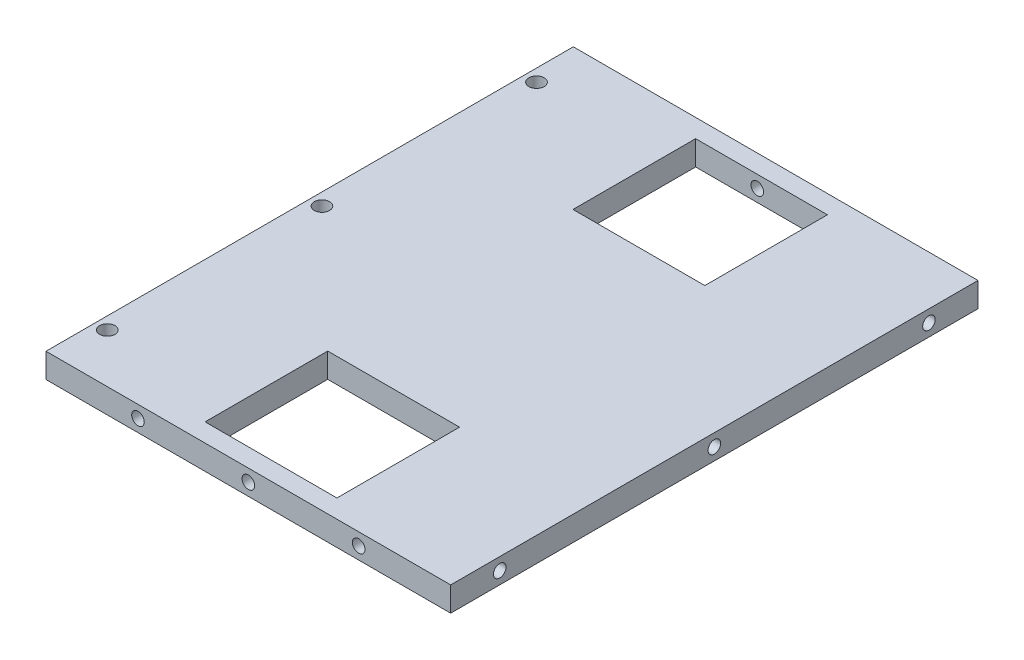
ISO-10303-21;
HEADER;
FILE_DESCRIPTION(('STEP AP214'),'2;1');
FILE_NAME('part.step','',(''),(''),'','','');
FILE_SCHEMA(('AUTOMOTIVE_DESIGN { 1 0 10303 214 1 1 1 1 }'));
ENDSEC;
DATA;
#1=APPLICATION_CONTEXT('core data for automotive mechanical design processes');
#2=APPLICATION_PROTOCOL_DEFINITION('international standard','automotive_design',2000,#1);
#3=PRODUCT_CONTEXT('',#1,'mechanical');
#4=PRODUCT('Part','Part','',(#3));
#5=PRODUCT_RELATED_PRODUCT_CATEGORY('part','',(#4));
#6=PRODUCT_DEFINITION_FORMATION('','',#4);
#7=PRODUCT_DEFINITION_CONTEXT('part definition',#1,'design');
#8=PRODUCT_DEFINITION('design','',#6,#7);
#9=PRODUCT_DEFINITION_SHAPE('','',#8);
#10=(LENGTH_UNIT() NAMED_UNIT(*) SI_UNIT(.MILLI.,.METRE.));
#11=(NAMED_UNIT(*) PLANE_ANGLE_UNIT() SI_UNIT($,.RADIAN.));
#12=(NAMED_UNIT(*) SI_UNIT($,.STERADIAN.) SOLID_ANGLE_UNIT());
#13=UNCERTAINTY_MEASURE_WITH_UNIT(LENGTH_MEASURE(1.E-05),#10,'distance_accuracy_value','');
#14=(GEOMETRIC_REPRESENTATION_CONTEXT(3) GLOBAL_UNCERTAINTY_ASSIGNED_CONTEXT((#13)) GLOBAL_UNIT_ASSIGNED_CONTEXT((#10,
#11,#12)) REPRESENTATION_CONTEXT('',''));
#15=CARTESIAN_POINT('',(0.,0.,0.));
#16=DIRECTION('',(0.,0.,1.));
#17=DIRECTION('',(1.,0.,0.));
#18=AXIS2_PLACEMENT_3D('',#15,#16,#17);
#19=CARTESIAN_POINT('',(0.,4.,0.));
#20=DIRECTION('',(0.,-1.,0.));
#21=DIRECTION('',(0.,0.,-1.));
#22=AXIS2_PLACEMENT_3D('',#19,#20,#21);
#23=PLANE('',#22);
#24=DIRECTION('',(0.,0.,1.));
#25=VECTOR('',#24,1.);
#26=CARTESIAN_POINT('',(22.9471530249112,4.,0.));
#27=LINE('',#26,#25);
#28=CARTESIAN_POINT('',(22.9471530249112,4.,19.9999999999999));
#29=VERTEX_POINT('',#28);
#30=CARTESIAN_POINT('',(22.9471530249112,4.,39.9999999999999));
#31=VERTEX_POINT('',#30);
#32=EDGE_CURVE('E263',#29,#31,#27,.T.);
#33=ORIENTED_EDGE('',*,*,#32,.F.);
#34=DIRECTION('',(-1.,0.,0.));
#35=VECTOR('',#34,1.);
#36=CARTESIAN_POINT('',(0.,4.,19.9999999999999));
#37=LINE('',#36,#35);
#38=CARTESIAN_POINT('',(44.4471530249111,4.,19.9999999999999));
#39=VERTEX_POINT('',#38);
#40=EDGE_CURVE('E256',#39,#29,#37,.T.);
#41=ORIENTED_EDGE('',*,*,#40,.F.);
#42=DIRECTION('',(0.,0.,-1.));
#43=VECTOR('',#42,1.);
#44=CARTESIAN_POINT('',(44.4471530249111,4.,0.));
#45=LINE('',#44,#43);
#46=CARTESIAN_POINT('',(44.4471530249111,4.,39.9999999999999));
#47=VERTEX_POINT('',#46);
#48=EDGE_CURVE('E258',#47,#39,#45,.T.);
#49=ORIENTED_EDGE('',*,*,#48,.F.);
#50=DIRECTION('',(1.,0.,0.));
#51=VECTOR('',#50,1.);
#52=CARTESIAN_POINT('',(0.,4.,39.9999999999999));
#53=LINE('',#52,#51);
#54=EDGE_CURVE('E261',#31,#47,#53,.T.);
#55=ORIENTED_EDGE('',*,*,#54,.F.);
#56=EDGE_LOOP('',(#33,#41,#49,#55));
#57=FACE_BOUND('',#56,.T.);
#58=DIRECTION('',(0.,0.,1.));
#59=VECTOR('',#58,1.);
#60=CARTESIAN_POINT('',(0.,4.,0.));
#61=LINE('',#60,#59);
#62=CARTESIAN_POINT('',(0.,4.,-43.));
#63=VERTEX_POINT('',#62);
#64=CARTESIAN_POINT('',(0.,4.,43.));
#65=VERTEX_POINT('',#64);
#66=EDGE_CURVE('E284',#63,#65,#61,.T.);
#67=ORIENTED_EDGE('',*,*,#66,.T.);
#68=DIRECTION('',(1.,0.,0.));
#69=VECTOR('',#68,1.);
#70=CARTESIAN_POINT('',(66.,4.,43.));
#71=LINE('',#70,#69);
#72=CARTESIAN_POINT('',(66.,4.,43.));
#73=VERTEX_POINT('',#72);
#74=EDGE_CURVE('E287',#65,#73,#71,.T.);
#75=ORIENTED_EDGE('',*,*,#74,.T.);
#76=DIRECTION('',(0.,0.,-1.));
#77=VECTOR('',#76,1.);
#78=CARTESIAN_POINT('',(66.,4.,-43.));
#79=LINE('',#78,#77);
#80=CARTESIAN_POINT('',(66.,4.,-43.));
#81=VERTEX_POINT('',#80);
#82=EDGE_CURVE('E290',#73,#81,#79,.T.);
#83=ORIENTED_EDGE('',*,*,#82,.T.);
#84=DIRECTION('',(-1.,0.,0.));
#85=VECTOR('',#84,1.);
#86=CARTESIAN_POINT('',(0.,4.,-43.));
#87=LINE('',#86,#85);
#88=EDGE_CURVE('E292',#81,#63,#87,.T.);
#89=ORIENTED_EDGE('',*,*,#88,.T.);
#90=EDGE_LOOP('',(#67,#75,#83,#89));
#91=FACE_BOUND('',#90,.T.);
#92=CARTESIAN_POINT('',(2.,4.,0.));
#93=DIRECTION('',(0.,1.,0.));
#94=DIRECTION('',(0.,0.,1.));
#95=AXIS2_PLACEMENT_3D('',#92,#93,#94);
#96=CIRCLE('',#95,1.25);
#97=CARTESIAN_POINT('',(2.,4.,1.25));
#98=VERTEX_POINT('',#97);
#99=EDGE_CURVE('E278',#98,#98,#96,.T.);
#100=ORIENTED_EDGE('',*,*,#99,.F.);
#101=EDGE_LOOP('',(#100));
#102=FACE_BOUND('',#101,.T.);
#103=CARTESIAN_POINT('',(1.99999999999988,4.,-35.));
#104=DIRECTION('',(0.,1.,0.));
#105=DIRECTION('',(0.,0.,1.));
#106=AXIS2_PLACEMENT_3D('',#103,#104,#105);
#107=CIRCLE('',#106,1.25);
#108=CARTESIAN_POINT('',(1.99999999999988,4.,-33.75));
#109=VERTEX_POINT('',#108);
#110=EDGE_CURVE('E272',#109,#109,#107,.T.);
#111=ORIENTED_EDGE('',*,*,#110,.F.);
#112=EDGE_LOOP('',(#111));
#113=FACE_BOUND('',#112,.T.);
#114=CARTESIAN_POINT('',(2.00000000000037,4.,35.));
#115=DIRECTION('',(0.,1.,0.));
#116=DIRECTION('',(0.,0.,1.));
#117=AXIS2_PLACEMENT_3D('',#114,#115,#116);
#118=CIRCLE('',#117,1.25);
#119=CARTESIAN_POINT('',(2.00000000000037,4.,36.25));
#120=VERTEX_POINT('',#119);
#121=EDGE_CURVE('E266',#120,#120,#118,.T.);
#122=ORIENTED_EDGE('',*,*,#121,.F.);
#123=EDGE_LOOP('',(#122));
#124=FACE_BOUND('',#123,.T.);
#125=DIRECTION('',(-1.,0.,0.));
#126=VECTOR('',#125,1.);
#127=CARTESIAN_POINT('',(0.,4.,-39.9999999999999));
#128=LINE('',#127,#126);
#129=CARTESIAN_POINT('',(44.4471530249111,4.,-39.9999999999999));
#130=VERTEX_POINT('',#129);
#131=CARTESIAN_POINT('',(22.9471530249112,4.,-39.9999999999999));
#132=VERTEX_POINT('',#131);
#133=EDGE_CURVE('E233',#130,#132,#128,.T.);
#134=ORIENTED_EDGE('',*,*,#133,.F.);
#135=DIRECTION('',(0.,0.,-1.));
#136=VECTOR('',#135,1.);
#137=CARTESIAN_POINT('',(44.4471530249111,4.,0.));
#138=LINE('',#137,#136);
#139=CARTESIAN_POINT('',(44.4471530249111,4.,-19.9999999999999));
#140=VERTEX_POINT('',#139);
#141=EDGE_CURVE('E227',#140,#130,#138,.T.);
#142=ORIENTED_EDGE('',*,*,#141,.F.);
#143=DIRECTION('',(1.,0.,0.));
#144=VECTOR('',#143,1.);
#145=CARTESIAN_POINT('',(0.,4.,-19.9999999999999));
#146=LINE('',#145,#144);
#147=CARTESIAN_POINT('',(22.9471530249112,4.,-19.9999999999999));
#148=VERTEX_POINT('',#147);
#149=EDGE_CURVE('E229',#148,#140,#146,.T.);
#150=ORIENTED_EDGE('',*,*,#149,.F.);
#151=DIRECTION('',(0.,0.,1.));
#152=VECTOR('',#151,1.);
#153=CARTESIAN_POINT('',(22.9471530249112,4.,0.));
#154=LINE('',#153,#152);
#155=EDGE_CURVE('E231',#132,#148,#154,.T.);
#156=ORIENTED_EDGE('',*,*,#155,.F.);
#157=EDGE_LOOP('',(#134,#142,#150,#156));
#158=FACE_BOUND('',#157,.T.);
#159=ADVANCED_FACE('F38',(#57,#91,#102,#113,#124,#158),#23,.F.);
#160=CARTESIAN_POINT('',(0.,0.,0.));
#161=DIRECTION('',(0.,-1.,0.));
#162=DIRECTION('',(0.,0.,-1.));
#163=AXIS2_PLACEMENT_3D('',#160,#161,#162);
#164=PLANE('',#163);
#165=CARTESIAN_POINT('',(1.99999999999988,0.,-35.));
#166=DIRECTION('',(0.,1.,0.));
#167=DIRECTION('',(0.,0.,1.));
#168=AXIS2_PLACEMENT_3D('',#165,#166,#167);
#169=CIRCLE('',#168,1.25);
#170=CARTESIAN_POINT('',(1.99999999999988,0.,-33.75));
#171=VERTEX_POINT('',#170);
#172=EDGE_CURVE('E269',#171,#171,#169,.T.);
#173=ORIENTED_EDGE('',*,*,#172,.T.);
#174=EDGE_LOOP('',(#173));
#175=FACE_BOUND('',#174,.T.);
#176=DIRECTION('',(1.,0.,0.));
#177=VECTOR('',#176,1.);
#178=CARTESIAN_POINT('',(66.,0.,43.));
#179=LINE('',#178,#177);
#180=CARTESIAN_POINT('',(0.,0.,43.));
#181=VERTEX_POINT('',#180);
#182=CARTESIAN_POINT('',(66.,0.,43.));
#183=VERTEX_POINT('',#182);
#184=EDGE_CURVE('E281',#181,#183,#179,.T.);
#185=ORIENTED_EDGE('',*,*,#184,.F.);
#186=DIRECTION('',(0.,0.,1.));
#187=VECTOR('',#186,1.);
#188=CARTESIAN_POINT('',(0.,0.,0.));
#189=LINE('',#188,#187);
#190=CARTESIAN_POINT('',(0.,0.,-43.));
#191=VERTEX_POINT('',#190);
#192=EDGE_CURVE('E288',#191,#181,#189,.T.);
#193=ORIENTED_EDGE('',*,*,#192,.F.);
#194=DIRECTION('',(-1.,0.,0.));
#195=VECTOR('',#194,1.);
#196=CARTESIAN_POINT('',(0.,0.,-43.));
#197=LINE('',#196,#195);
#198=CARTESIAN_POINT('',(66.,0.,-43.));
#199=VERTEX_POINT('',#198);
#200=EDGE_CURVE('E299',#199,#191,#197,.T.);
#201=ORIENTED_EDGE('',*,*,#200,.F.);
#202=DIRECTION('',(0.,0.,-1.));
#203=VECTOR('',#202,1.);
#204=CARTESIAN_POINT('',(66.,0.,-43.));
#205=LINE('',#204,#203);
#206=EDGE_CURVE('E297',#183,#199,#205,.T.);
#207=ORIENTED_EDGE('',*,*,#206,.F.);
#208=EDGE_LOOP('',(#185,#193,#201,#207));
#209=FACE_BOUND('',#208,.T.);
#210=CARTESIAN_POINT('',(2.,0.,0.));
#211=DIRECTION('',(0.,1.,0.));
#212=DIRECTION('',(0.,0.,1.));
#213=AXIS2_PLACEMENT_3D('',#210,#211,#212);
#214=CIRCLE('',#213,1.25);
#215=CARTESIAN_POINT('',(2.,0.,1.25));
#216=VERTEX_POINT('',#215);
#217=EDGE_CURVE('E275',#216,#216,#214,.T.);
#218=ORIENTED_EDGE('',*,*,#217,.T.);
#219=EDGE_LOOP('',(#218));
#220=FACE_BOUND('',#219,.T.);
#221=CARTESIAN_POINT('',(2.00000000000037,0.,35.));
#222=DIRECTION('',(0.,1.,0.));
#223=DIRECTION('',(0.,0.,1.));
#224=AXIS2_PLACEMENT_3D('',#221,#222,#223);
#225=CIRCLE('',#224,1.25);
#226=CARTESIAN_POINT('',(2.00000000000037,0.,36.25));
#227=VERTEX_POINT('',#226);
#228=EDGE_CURVE('E265',#227,#227,#225,.T.);
#229=ORIENTED_EDGE('',*,*,#228,.T.);
#230=EDGE_LOOP('',(#229));
#231=FACE_BOUND('',#230,.T.);
#232=DIRECTION('',(-1.,0.,0.));
#233=VECTOR('',#232,1.);
#234=CARTESIAN_POINT('',(44.4471530249111,0.,19.9999999999999));
#235=LINE('',#234,#233);
#236=CARTESIAN_POINT('',(44.4471530249111,0.,19.9999999999999));
#237=VERTEX_POINT('',#236);
#238=CARTESIAN_POINT('',(22.9471530249112,0.,19.9999999999999));
#239=VERTEX_POINT('',#238);
#240=EDGE_CURVE('E244',#237,#239,#235,.T.);
#241=ORIENTED_EDGE('',*,*,#240,.T.);
#242=DIRECTION('',(0.,0.,1.));
#243=VECTOR('',#242,1.);
#244=CARTESIAN_POINT('',(22.9471530249112,0.,39.9999999999999));
#245=LINE('',#244,#243);
#246=CARTESIAN_POINT('',(22.9471530249112,0.,39.9999999999999));
#247=VERTEX_POINT('',#246);
#248=EDGE_CURVE('E235',#239,#247,#245,.T.);
#249=ORIENTED_EDGE('',*,*,#248,.T.);
#250=DIRECTION('',(1.,0.,0.));
#251=VECTOR('',#250,1.);
#252=CARTESIAN_POINT('',(22.9471530249112,0.,39.9999999999999));
#253=LINE('',#252,#251);
#254=CARTESIAN_POINT('',(44.4471530249111,0.,39.9999999999999));
#255=VERTEX_POINT('',#254);
#256=EDGE_CURVE('E238',#247,#255,#253,.T.);
#257=ORIENTED_EDGE('',*,*,#256,.T.);
#258=DIRECTION('',(0.,0.,-1.));
#259=VECTOR('',#258,1.);
#260=CARTESIAN_POINT('',(44.4471530249111,0.,39.9999999999999));
#261=LINE('',#260,#259);
#262=EDGE_CURVE('E241',#255,#237,#261,.T.);
#263=ORIENTED_EDGE('',*,*,#262,.T.);
#264=EDGE_LOOP('',(#241,#249,#257,#263));
#265=FACE_BOUND('',#264,.T.);
#266=DIRECTION('',(0.,0.,-1.));
#267=VECTOR('',#266,1.);
#268=CARTESIAN_POINT('',(44.4471530249111,0.,-39.9999999999999));
#269=LINE('',#268,#267);
#270=CARTESIAN_POINT('',(44.4471530249111,0.,-19.9999999999999));
#271=VERTEX_POINT('',#270);
#272=CARTESIAN_POINT('',(44.4471530249111,0.,-39.9999999999999));
#273=VERTEX_POINT('',#272);
#274=EDGE_CURVE('E217',#271,#273,#269,.T.);
#275=ORIENTED_EDGE('',*,*,#274,.T.);
#276=DIRECTION('',(-1.,0.,0.));
#277=VECTOR('',#276,1.);
#278=CARTESIAN_POINT('',(22.9471530249112,0.,-39.9999999999999));
#279=LINE('',#278,#277);
#280=CARTESIAN_POINT('',(22.9471530249112,0.,-39.9999999999999));
#281=VERTEX_POINT('',#280);
#282=EDGE_CURVE('E61',#273,#281,#279,.T.);
#283=ORIENTED_EDGE('',*,*,#282,.T.);
#284=DIRECTION('',(0.,0.,1.));
#285=VECTOR('',#284,1.);
#286=CARTESIAN_POINT('',(22.9471530249112,0.,-39.9999999999999));
#287=LINE('',#286,#285);
#288=CARTESIAN_POINT('',(22.9471530249112,0.,-19.9999999999999));
#289=VERTEX_POINT('',#288);
#290=EDGE_CURVE('E211',#281,#289,#287,.T.);
#291=ORIENTED_EDGE('',*,*,#290,.T.);
#292=DIRECTION('',(1.,0.,0.));
#293=VECTOR('',#292,1.);
#294=CARTESIAN_POINT('',(44.4471530249111,0.,-19.9999999999999));
#295=LINE('',#294,#293);
#296=EDGE_CURVE('E214',#289,#271,#295,.T.);
#297=ORIENTED_EDGE('',*,*,#296,.T.);
#298=EDGE_LOOP('',(#275,#283,#291,#297));
#299=FACE_BOUND('',#298,.T.);
#300=ADVANCED_FACE('F317',(#175,#209,#220,#231,#265,#299),#164,.T.);
#301=CARTESIAN_POINT('',(66.,4.,43.));
#302=DIRECTION('',(0.,0.,-1.));
#303=DIRECTION('',(-1.,0.,0.));
#304=AXIS2_PLACEMENT_3D('',#301,#302,#303);
#305=PLANE('',#304);
#306=CARTESIAN_POINT('',(15.,2.,43.));
#307=DIRECTION('',(0.,0.,1.));
#308=DIRECTION('',(1.,0.,0.));
#309=AXIS2_PLACEMENT_3D('',#306,#307,#308);
#310=CIRCLE('',#309,1.02499999999999);
#311=CARTESIAN_POINT('',(16.025,2.,43.));
#312=VERTEX_POINT('',#311);
#313=EDGE_CURVE('E192',#312,#312,#310,.T.);
#314=ORIENTED_EDGE('',*,*,#313,.F.);
#315=EDGE_LOOP('',(#314));
#316=FACE_BOUND('',#315,.T.);
#317=CARTESIAN_POINT('',(33.,2.,43.));
#318=DIRECTION('',(0.,0.,1.));
#319=DIRECTION('',(1.,0.,0.));
#320=AXIS2_PLACEMENT_3D('',#317,#318,#319);
#321=CIRCLE('',#320,1.02499999999999);
#322=CARTESIAN_POINT('',(34.025,2.,43.));
#323=VERTEX_POINT('',#322);
#324=EDGE_CURVE('E198',#323,#323,#321,.T.);
#325=ORIENTED_EDGE('',*,*,#324,.F.);
#326=EDGE_LOOP('',(#325));
#327=FACE_BOUND('',#326,.T.);
#328=CARTESIAN_POINT('',(51.,2.,43.));
#329=DIRECTION('',(0.,0.,1.));
#330=DIRECTION('',(1.,0.,0.));
#331=AXIS2_PLACEMENT_3D('',#328,#329,#330);
#332=CIRCLE('',#331,1.02499999999999);
#333=CARTESIAN_POINT('',(52.025,2.,43.));
#334=VERTEX_POINT('',#333);
#335=EDGE_CURVE('E204',#334,#334,#332,.T.);
#336=ORIENTED_EDGE('',*,*,#335,.F.);
#337=EDGE_LOOP('',(#336));
#338=FACE_BOUND('',#337,.T.);
#339=ORIENTED_EDGE('',*,*,#184,.T.);
#340=DIRECTION('',(0.,-1.,0.));
#341=VECTOR('',#340,1.);
#342=CARTESIAN_POINT('',(66.,4.,43.));
#343=LINE('',#342,#341);
#344=EDGE_CURVE('E46',#73,#183,#343,.T.);
#345=ORIENTED_EDGE('',*,*,#344,.F.);
#346=ORIENTED_EDGE('',*,*,#74,.F.);
#347=DIRECTION('',(0.,-1.,0.));
#348=VECTOR('',#347,1.);
#349=CARTESIAN_POINT('',(0.,4.,43.));
#350=LINE('',#349,#348);
#351=EDGE_CURVE('E11',#65,#181,#350,.T.);
#352=ORIENTED_EDGE('',*,*,#351,.T.);
#353=EDGE_LOOP('',(#339,#345,#346,#352));
#354=FACE_BOUND('',#353,.T.);
#355=ADVANCED_FACE('F40',(#316,#327,#338,#354),#305,.F.);
#356=CARTESIAN_POINT('',(66.,4.,-43.));
#357=DIRECTION('',(-1.,0.,0.));
#358=DIRECTION('',(0.,0.,1.));
#359=AXIS2_PLACEMENT_3D('',#356,#357,#358);
#360=PLANE('',#359);
#361=CARTESIAN_POINT('',(66.,2.,0.));
#362=DIRECTION('',(1.,0.,0.));
#363=DIRECTION('',(0.,0.,-1.));
#364=AXIS2_PLACEMENT_3D('',#361,#362,#363);
#365=CIRCLE('',#364,1.02499999999999);
#366=CARTESIAN_POINT('',(66.,2.,-1.02499999999999));
#367=VERTEX_POINT('',#366);
#368=EDGE_CURVE('E158',#367,#367,#365,.T.);
#369=ORIENTED_EDGE('',*,*,#368,.F.);
#370=EDGE_LOOP('',(#369));
#371=FACE_BOUND('',#370,.T.);
#372=CARTESIAN_POINT('',(66.,1.99999999999976,35.));
#373=DIRECTION('',(1.,0.,0.));
#374=DIRECTION('',(0.,0.,-1.));
#375=AXIS2_PLACEMENT_3D('',#372,#373,#374);
#376=CIRCLE('',#375,1.02499999999999);
#377=CARTESIAN_POINT('',(66.,1.99999999999976,33.975));
#378=VERTEX_POINT('',#377);
#379=EDGE_CURVE('E157',#378,#378,#376,.T.);
#380=ORIENTED_EDGE('',*,*,#379,.F.);
#381=EDGE_LOOP('',(#380));
#382=FACE_BOUND('',#381,.T.);
#383=CARTESIAN_POINT('',(66.,2.00000000000049,-35.));
#384=DIRECTION('',(1.,0.,0.));
#385=DIRECTION('',(0.,0.,-1.));
#386=AXIS2_PLACEMENT_3D('',#383,#384,#385);
#387=CIRCLE('',#386,1.02499999999999);
#388=CARTESIAN_POINT('',(66.,2.00000000000049,-36.025));
#389=VERTEX_POINT('',#388);
#390=EDGE_CURVE('E168',#389,#389,#387,.T.);
#391=ORIENTED_EDGE('',*,*,#390,.F.);
#392=EDGE_LOOP('',(#391));
#393=FACE_BOUND('',#392,.T.);
#394=ORIENTED_EDGE('',*,*,#206,.T.);
#395=DIRECTION('',(0.,-1.,0.));
#396=VECTOR('',#395,1.);
#397=CARTESIAN_POINT('',(66.,4.,-43.));
#398=LINE('',#397,#396);
#399=EDGE_CURVE('E304',#81,#199,#398,.T.);
#400=ORIENTED_EDGE('',*,*,#399,.F.);
#401=ORIENTED_EDGE('',*,*,#82,.F.);
#402=ORIENTED_EDGE('',*,*,#344,.T.);
#403=EDGE_LOOP('',(#394,#400,#401,#402));
#404=FACE_BOUND('',#403,.T.);
#405=ADVANCED_FACE('F311',(#371,#382,#393,#404),#360,.F.);
#406=CARTESIAN_POINT('',(0.,4.,-43.));
#407=DIRECTION('',(0.,0.,1.));
#408=DIRECTION('',(1.,0.,0.));
#409=AXIS2_PLACEMENT_3D('',#406,#407,#408);
#410=PLANE('',#409);
#411=CARTESIAN_POINT('',(15.,2.,-43.));
#412=DIRECTION('',(0.,0.,-1.));
#413=DIRECTION('',(-1.,0.,0.));
#414=AXIS2_PLACEMENT_3D('',#411,#412,#413);
#415=CIRCLE('',#414,1.02499999999999);
#416=CARTESIAN_POINT('',(13.975,2.,-43.));
#417=VERTEX_POINT('',#416);
#418=EDGE_CURVE('E174',#417,#417,#415,.T.);
#419=ORIENTED_EDGE('',*,*,#418,.F.);
#420=EDGE_LOOP('',(#419));
#421=FACE_BOUND('',#420,.T.);
#422=CARTESIAN_POINT('',(33.,2.,-43.));
#423=DIRECTION('',(0.,0.,-1.));
#424=DIRECTION('',(-1.,0.,0.));
#425=AXIS2_PLACEMENT_3D('',#422,#423,#424);
#426=CIRCLE('',#425,1.02499999999999);
#427=CARTESIAN_POINT('',(31.975,2.,-43.));
#428=VERTEX_POINT('',#427);
#429=EDGE_CURVE('E180',#428,#428,#426,.T.);
#430=ORIENTED_EDGE('',*,*,#429,.F.);
#431=EDGE_LOOP('',(#430));
#432=FACE_BOUND('',#431,.T.);
#433=CARTESIAN_POINT('',(51.,2.,-43.));
#434=DIRECTION('',(0.,0.,-1.));
#435=DIRECTION('',(-1.,0.,0.));
#436=AXIS2_PLACEMENT_3D('',#433,#434,#435);
#437=CIRCLE('',#436,1.02499999999999);
#438=CARTESIAN_POINT('',(49.975,2.,-43.));
#439=VERTEX_POINT('',#438);
#440=EDGE_CURVE('E186',#439,#439,#437,.T.);
#441=ORIENTED_EDGE('',*,*,#440,.F.);
#442=EDGE_LOOP('',(#441));
#443=FACE_BOUND('',#442,.T.);
#444=ORIENTED_EDGE('',*,*,#200,.T.);
#445=DIRECTION('',(0.,-1.,0.));
#446=VECTOR('',#445,1.);
#447=CARTESIAN_POINT('',(0.,4.,-43.));
#448=LINE('',#447,#446);
#449=EDGE_CURVE('E295',#63,#191,#448,.T.);
#450=ORIENTED_EDGE('',*,*,#449,.F.);
#451=ORIENTED_EDGE('',*,*,#88,.F.);
#452=ORIENTED_EDGE('',*,*,#399,.T.);
#453=EDGE_LOOP('',(#444,#450,#451,#452));
#454=FACE_BOUND('',#453,.T.);
#455=ADVANCED_FACE('F322',(#421,#432,#443,#454),#410,.F.);
#456=CARTESIAN_POINT('',(0.,4.,0.));
#457=DIRECTION('',(1.,0.,0.));
#458=DIRECTION('',(0.,0.,-1.));
#459=AXIS2_PLACEMENT_3D('',#456,#457,#458);
#460=PLANE('',#459);
#461=ORIENTED_EDGE('',*,*,#192,.T.);
#462=ORIENTED_EDGE('',*,*,#351,.F.);
#463=ORIENTED_EDGE('',*,*,#66,.F.);
#464=ORIENTED_EDGE('',*,*,#449,.T.);
#465=EDGE_LOOP('',(#461,#462,#463,#464));
#466=FACE_BOUND('',#465,.T.);
#467=ADVANCED_FACE('F325',(#466),#460,.F.);
#468=CARTESIAN_POINT('',(2.,4.,0.));
#469=DIRECTION('',(0.,-1.,0.));
#470=DIRECTION('',(0.,0.,-1.));
#471=AXIS2_PLACEMENT_3D('',#468,#469,#470);
#472=CYLINDRICAL_SURFACE('',#471,1.25);
#473=ORIENTED_EDGE('',*,*,#99,.T.);
#474=EDGE_LOOP('',(#473));
#475=FACE_BOUND('',#474,.T.);
#476=ORIENTED_EDGE('',*,*,#217,.F.);
#477=EDGE_LOOP('',(#476));
#478=FACE_BOUND('',#477,.T.);
#479=ADVANCED_FACE('F349',(#475,#478),#472,.F.);
#480=CARTESIAN_POINT('',(1.99999999999988,4.,-35.));
#481=DIRECTION('',(0.,-1.,0.));
#482=DIRECTION('',(0.,0.,-1.));
#483=AXIS2_PLACEMENT_3D('',#480,#481,#482);
#484=CYLINDRICAL_SURFACE('',#483,1.25);
#485=ORIENTED_EDGE('',*,*,#110,.T.);
#486=EDGE_LOOP('',(#485));
#487=FACE_BOUND('',#486,.T.);
#488=ORIENTED_EDGE('',*,*,#172,.F.);
#489=EDGE_LOOP('',(#488));
#490=FACE_BOUND('',#489,.T.);
#491=ADVANCED_FACE('F435',(#487,#490),#484,.F.);
#492=CARTESIAN_POINT('',(2.00000000000037,4.,35.));
#493=DIRECTION('',(0.,-1.,0.));
#494=DIRECTION('',(0.,0.,-1.));
#495=AXIS2_PLACEMENT_3D('',#492,#493,#494);
#496=CYLINDRICAL_SURFACE('',#495,1.25);
#497=ORIENTED_EDGE('',*,*,#121,.T.);
#498=EDGE_LOOP('',(#497));
#499=FACE_BOUND('',#498,.T.);
#500=ORIENTED_EDGE('',*,*,#228,.F.);
#501=EDGE_LOOP('',(#500));
#502=FACE_BOUND('',#501,.T.);
#503=ADVANCED_FACE('F432',(#499,#502),#496,.F.);
#504=CARTESIAN_POINT('',(22.9471530249112,8.,39.9999999999999));
#505=DIRECTION('',(1.,0.,0.));
#506=DIRECTION('',(0.,0.,-1.));
#507=AXIS2_PLACEMENT_3D('',#504,#505,#506);
#508=PLANE('',#507);
#509=ORIENTED_EDGE('',*,*,#32,.T.);
#510=DIRECTION('',(0.,-1.,0.));
#511=VECTOR('',#510,1.);
#512=CARTESIAN_POINT('',(22.9471530249112,8.,39.9999999999999));
#513=LINE('',#512,#511);
#514=EDGE_CURVE('E254',#31,#247,#513,.T.);
#515=ORIENTED_EDGE('',*,*,#514,.T.);
#516=ORIENTED_EDGE('',*,*,#248,.F.);
#517=DIRECTION('',(0.,-1.,0.));
#518=VECTOR('',#517,1.);
#519=CARTESIAN_POINT('',(22.9471530249112,8.,19.9999999999999));
#520=LINE('',#519,#518);
#521=EDGE_CURVE('E247',#29,#239,#520,.T.);
#522=ORIENTED_EDGE('',*,*,#521,.F.);
#523=EDGE_LOOP('',(#509,#515,#516,#522));
#524=FACE_BOUND('',#523,.T.);
#525=ADVANCED_FACE('F428',(#524),#508,.T.);
#526=CARTESIAN_POINT('',(22.9471530249112,8.,39.9999999999999));
#527=DIRECTION('',(0.,0.,-1.));
#528=DIRECTION('',(-1.,0.,0.));
#529=AXIS2_PLACEMENT_3D('',#526,#527,#528);
#530=PLANE('',#529);
#531=CARTESIAN_POINT('',(33.,2.,39.9999999999999));
#532=DIRECTION('',(0.,0.,-1.));
#533=DIRECTION('',(-1.,0.,0.));
#534=AXIS2_PLACEMENT_3D('',#531,#532,#533);
#535=CIRCLE('',#534,1.02499999999999);
#536=CARTESIAN_POINT('',(31.975,2.,39.9999999999999));
#537=VERTEX_POINT('',#536);
#538=EDGE_CURVE('E201',#537,#537,#535,.T.);
#539=ORIENTED_EDGE('',*,*,#538,.F.);
#540=EDGE_LOOP('',(#539));
#541=FACE_BOUND('',#540,.T.);
#542=ORIENTED_EDGE('',*,*,#54,.T.);
#543=DIRECTION('',(0.,-1.,0.));
#544=VECTOR('',#543,1.);
#545=CARTESIAN_POINT('',(44.4471530249111,8.,39.9999999999999));
#546=LINE('',#545,#544);
#547=EDGE_CURVE('E252',#47,#255,#546,.T.);
#548=ORIENTED_EDGE('',*,*,#547,.T.);
#549=ORIENTED_EDGE('',*,*,#256,.F.);
#550=ORIENTED_EDGE('',*,*,#514,.F.);
#551=EDGE_LOOP('',(#542,#548,#549,#550));
#552=FACE_BOUND('',#551,.T.);
#553=ADVANCED_FACE('F425',(#541,#552),#530,.T.);
#554=CARTESIAN_POINT('',(44.4471530249111,8.,39.9999999999999));
#555=DIRECTION('',(-1.,0.,0.));
#556=DIRECTION('',(0.,0.,1.));
#557=AXIS2_PLACEMENT_3D('',#554,#555,#556);
#558=PLANE('',#557);
#559=ORIENTED_EDGE('',*,*,#48,.T.);
#560=DIRECTION('',(0.,-1.,0.));
#561=VECTOR('',#560,1.);
#562=CARTESIAN_POINT('',(44.4471530249111,8.,19.9999999999999));
#563=LINE('',#562,#561);
#564=EDGE_CURVE('E250',#39,#237,#563,.T.);
#565=ORIENTED_EDGE('',*,*,#564,.T.);
#566=ORIENTED_EDGE('',*,*,#262,.F.);
#567=ORIENTED_EDGE('',*,*,#547,.F.);
#568=EDGE_LOOP('',(#559,#565,#566,#567));
#569=FACE_BOUND('',#568,.T.);
#570=ADVANCED_FACE('F421',(#569),#558,.T.);
#571=CARTESIAN_POINT('',(44.4471530249111,8.,19.9999999999999));
#572=DIRECTION('',(0.,0.,1.));
#573=DIRECTION('',(1.,0.,0.));
#574=AXIS2_PLACEMENT_3D('',#571,#572,#573);
#575=PLANE('',#574);
#576=ORIENTED_EDGE('',*,*,#40,.T.);
#577=ORIENTED_EDGE('',*,*,#521,.T.);
#578=ORIENTED_EDGE('',*,*,#240,.F.);
#579=ORIENTED_EDGE('',*,*,#564,.F.);
#580=EDGE_LOOP('',(#576,#577,#578,#579));
#581=FACE_BOUND('',#580,.T.);
#582=ADVANCED_FACE('F417',(#581),#575,.T.);
#583=CARTESIAN_POINT('',(22.9471530249112,8.,-39.9999999999999));
#584=DIRECTION('',(0.,0.,1.));
#585=DIRECTION('',(1.,0.,0.));
#586=AXIS2_PLACEMENT_3D('',#583,#584,#585);
#587=PLANE('',#586);
#588=CARTESIAN_POINT('',(33.,2.,-39.9999999999999));
#589=DIRECTION('',(0.,0.,1.));
#590=DIRECTION('',(1.,0.,0.));
#591=AXIS2_PLACEMENT_3D('',#588,#589,#590);
#592=CIRCLE('',#591,1.02499999999999);
#593=CARTESIAN_POINT('',(34.025,2.,-39.9999999999999));
#594=VERTEX_POINT('',#593);
#595=EDGE_CURVE('E183',#594,#594,#592,.T.);
#596=ORIENTED_EDGE('',*,*,#595,.F.);
#597=EDGE_LOOP('',(#596));
#598=FACE_BOUND('',#597,.T.);
#599=ORIENTED_EDGE('',*,*,#133,.T.);
#600=DIRECTION('',(0.,-1.,0.));
#601=VECTOR('',#600,1.);
#602=CARTESIAN_POINT('',(22.9471530249112,8.,-39.9999999999999));
#603=LINE('',#602,#601);
#604=EDGE_CURVE('E225',#132,#281,#603,.T.);
#605=ORIENTED_EDGE('',*,*,#604,.T.);
#606=ORIENTED_EDGE('',*,*,#282,.F.);
#607=DIRECTION('',(0.,-1.,0.));
#608=VECTOR('',#607,1.);
#609=CARTESIAN_POINT('',(44.4471530249111,8.,-39.9999999999999));
#610=LINE('',#609,#608);
#611=EDGE_CURVE('E220',#130,#273,#610,.T.);
#612=ORIENTED_EDGE('',*,*,#611,.F.);
#613=EDGE_LOOP('',(#599,#605,#606,#612));
#614=FACE_BOUND('',#613,.T.);
#615=ADVANCED_FACE('F414',(#598,#614),#587,.T.);
#616=CARTESIAN_POINT('',(22.9471530249112,8.,-39.9999999999999));
#617=DIRECTION('',(1.,0.,0.));
#618=DIRECTION('',(0.,0.,-1.));
#619=AXIS2_PLACEMENT_3D('',#616,#617,#618);
#620=PLANE('',#619);
#621=ORIENTED_EDGE('',*,*,#155,.T.);
#622=DIRECTION('',(0.,-1.,0.));
#623=VECTOR('',#622,1.);
#624=CARTESIAN_POINT('',(22.9471530249112,8.,-19.9999999999999));
#625=LINE('',#624,#623);
#626=EDGE_CURVE('E223',#148,#289,#625,.T.);
#627=ORIENTED_EDGE('',*,*,#626,.T.);
#628=ORIENTED_EDGE('',*,*,#290,.F.);
#629=ORIENTED_EDGE('',*,*,#604,.F.);
#630=EDGE_LOOP('',(#621,#627,#628,#629));
#631=FACE_BOUND('',#630,.T.);
#632=ADVANCED_FACE('F410',(#631),#620,.T.);
#633=CARTESIAN_POINT('',(44.4471530249111,8.,-19.9999999999999));
#634=DIRECTION('',(0.,0.,-1.));
#635=DIRECTION('',(-1.,0.,0.));
#636=AXIS2_PLACEMENT_3D('',#633,#634,#635);
#637=PLANE('',#636);
#638=ORIENTED_EDGE('',*,*,#149,.T.);
#639=DIRECTION('',(0.,-1.,0.));
#640=VECTOR('',#639,1.);
#641=CARTESIAN_POINT('',(44.4471530249111,8.,-19.9999999999999));
#642=LINE('',#641,#640);
#643=EDGE_CURVE('E53',#140,#271,#642,.T.);
#644=ORIENTED_EDGE('',*,*,#643,.T.);
#645=ORIENTED_EDGE('',*,*,#296,.F.);
#646=ORIENTED_EDGE('',*,*,#626,.F.);
#647=EDGE_LOOP('',(#638,#644,#645,#646));
#648=FACE_BOUND('',#647,.T.);
#649=ADVANCED_FACE('F407',(#648),#637,.T.);
#650=CARTESIAN_POINT('',(44.4471530249111,8.,-39.9999999999999));
#651=DIRECTION('',(-1.,0.,0.));
#652=DIRECTION('',(0.,0.,1.));
#653=AXIS2_PLACEMENT_3D('',#650,#651,#652);
#654=PLANE('',#653);
#655=ORIENTED_EDGE('',*,*,#141,.T.);
#656=ORIENTED_EDGE('',*,*,#611,.T.);
#657=ORIENTED_EDGE('',*,*,#274,.F.);
#658=ORIENTED_EDGE('',*,*,#643,.F.);
#659=EDGE_LOOP('',(#655,#656,#657,#658));
#660=FACE_BOUND('',#659,.T.);
#661=ADVANCED_FACE('F403',(#660),#654,.T.);
#662=CARTESIAN_POINT('',(51.,2.,34.75));
#663=DIRECTION('',(0.,0.,1.));
#664=DIRECTION('',(1.,0.,0.));
#665=AXIS2_PLACEMENT_3D('',#662,#663,#664);
#666=CONICAL_SURFACE('',#665,1.02499999999998,1.02974425867664);
#667=CARTESIAN_POINT('',(51.,2.,34.1341178654967));
#668=VERTEX_POINT('',#667);
#669=VERTEX_LOOP('',#668);
#670=FACE_BOUND('',#669,.T.);
#671=CARTESIAN_POINT('',(51.,2.,34.75));
#672=DIRECTION('',(0.,0.,1.));
#673=DIRECTION('',(1.,0.,0.));
#674=AXIS2_PLACEMENT_3D('',#671,#672,#673);
#675=CIRCLE('',#674,1.02499999999998);
#676=CARTESIAN_POINT('',(52.025,2.,34.75));
#677=VERTEX_POINT('',#676);
#678=EDGE_CURVE('E207',#677,#677,#675,.T.);
#679=ORIENTED_EDGE('',*,*,#678,.T.);
#680=EDGE_LOOP('',(#679));
#681=FACE_BOUND('',#680,.T.);
#682=ADVANCED_FACE('F399',(#670,#681),#666,.F.);
#683=CARTESIAN_POINT('',(51.,2.,43.));
#684=DIRECTION('',(0.,0.,1.));
#685=DIRECTION('',(1.,0.,0.));
#686=AXIS2_PLACEMENT_3D('',#683,#684,#685);
#687=CYLINDRICAL_SURFACE('',#686,1.02499999999999);
#688=ORIENTED_EDGE('',*,*,#678,.F.);
#689=EDGE_LOOP('',(#688));
#690=FACE_BOUND('',#689,.T.);
#691=ORIENTED_EDGE('',*,*,#335,.T.);
#692=EDGE_LOOP('',(#691));
#693=FACE_BOUND('',#692,.T.);
#694=ADVANCED_FACE('F395',(#690,#693),#687,.F.);
#695=CARTESIAN_POINT('',(33.,2.,43.));
#696=DIRECTION('',(0.,0.,1.));
#697=DIRECTION('',(1.,0.,0.));
#698=AXIS2_PLACEMENT_3D('',#695,#696,#697);
#699=CYLINDRICAL_SURFACE('',#698,1.02499999999999);
#700=ORIENTED_EDGE('',*,*,#538,.T.);
#701=EDGE_LOOP('',(#700));
#702=FACE_BOUND('',#701,.T.);
#703=ORIENTED_EDGE('',*,*,#324,.T.);
#704=EDGE_LOOP('',(#703));
#705=FACE_BOUND('',#704,.T.);
#706=ADVANCED_FACE('F391',(#702,#705),#699,.F.);
#707=CARTESIAN_POINT('',(15.,2.,34.75));
#708=DIRECTION('',(0.,0.,1.));
#709=DIRECTION('',(1.,0.,0.));
#710=AXIS2_PLACEMENT_3D('',#707,#708,#709);
#711=CONICAL_SURFACE('',#710,1.02499999999999,1.02974425867665);
#712=CARTESIAN_POINT('',(15.,2.,34.1341178654967));
#713=VERTEX_POINT('',#712);
#714=VERTEX_LOOP('',#713);
#715=FACE_BOUND('',#714,.T.);
#716=CARTESIAN_POINT('',(15.,2.,34.75));
#717=DIRECTION('',(0.,0.,1.));
#718=DIRECTION('',(1.,0.,0.));
#719=AXIS2_PLACEMENT_3D('',#716,#717,#718);
#720=CIRCLE('',#719,1.02499999999999);
#721=CARTESIAN_POINT('',(16.025,2.,34.75));
#722=VERTEX_POINT('',#721);
#723=EDGE_CURVE('E195',#722,#722,#720,.T.);
#724=ORIENTED_EDGE('',*,*,#723,.T.);
#725=EDGE_LOOP('',(#724));
#726=FACE_BOUND('',#725,.T.);
#727=ADVANCED_FACE('F387',(#715,#726),#711,.F.);
#728=CARTESIAN_POINT('',(15.,2.,43.));
#729=DIRECTION('',(0.,0.,1.));
#730=DIRECTION('',(1.,0.,0.));
#731=AXIS2_PLACEMENT_3D('',#728,#729,#730);
#732=CYLINDRICAL_SURFACE('',#731,1.02499999999999);
#733=ORIENTED_EDGE('',*,*,#723,.F.);
#734=EDGE_LOOP('',(#733));
#735=FACE_BOUND('',#734,.T.);
#736=ORIENTED_EDGE('',*,*,#313,.T.);
#737=EDGE_LOOP('',(#736));
#738=FACE_BOUND('',#737,.T.);
#739=ADVANCED_FACE('F379',(#735,#738),#732,.F.);
#740=CARTESIAN_POINT('',(51.,2.,-34.75));
#741=DIRECTION('',(0.,0.,-1.));
#742=DIRECTION('',(-1.,0.,0.));
#743=AXIS2_PLACEMENT_3D('',#740,#741,#742);
#744=CONICAL_SURFACE('',#743,1.02499999999998,1.02974425867664);
#745=CARTESIAN_POINT('',(51.,2.,-34.1341178654967));
#746=VERTEX_POINT('',#745);
#747=VERTEX_LOOP('',#746);
#748=FACE_BOUND('',#747,.T.);
#749=CARTESIAN_POINT('',(51.,2.,-34.75));
#750=DIRECTION('',(0.,0.,-1.));
#751=DIRECTION('',(-1.,0.,0.));
#752=AXIS2_PLACEMENT_3D('',#749,#750,#751);
#753=CIRCLE('',#752,1.02499999999998);
#754=CARTESIAN_POINT('',(49.975,2.,-34.75));
#755=VERTEX_POINT('',#754);
#756=EDGE_CURVE('E189',#755,#755,#753,.T.);
#757=ORIENTED_EDGE('',*,*,#756,.T.);
#758=EDGE_LOOP('',(#757));
#759=FACE_BOUND('',#758,.T.);
#760=ADVANCED_FACE('F369',(#748,#759),#744,.F.);
#761=CARTESIAN_POINT('',(51.,2.,-43.));
#762=DIRECTION('',(0.,0.,-1.));
#763=DIRECTION('',(-1.,0.,0.));
#764=AXIS2_PLACEMENT_3D('',#761,#762,#763);
#765=CYLINDRICAL_SURFACE('',#764,1.02499999999999);
#766=ORIENTED_EDGE('',*,*,#756,.F.);
#767=EDGE_LOOP('',(#766));
#768=FACE_BOUND('',#767,.T.);
#769=ORIENTED_EDGE('',*,*,#440,.T.);
#770=EDGE_LOOP('',(#769));
#771=FACE_BOUND('',#770,.T.);
#772=ADVANCED_FACE('F366',(#768,#771),#765,.F.);
#773=CARTESIAN_POINT('',(33.,2.,-43.));
#774=DIRECTION('',(0.,0.,-1.));
#775=DIRECTION('',(-1.,0.,0.));
#776=AXIS2_PLACEMENT_3D('',#773,#774,#775);
#777=CYLINDRICAL_SURFACE('',#776,1.02499999999999);
#778=ORIENTED_EDGE('',*,*,#595,.T.);
#779=EDGE_LOOP('',(#778));
#780=FACE_BOUND('',#779,.T.);
#781=ORIENTED_EDGE('',*,*,#429,.T.);
#782=EDGE_LOOP('',(#781));
#783=FACE_BOUND('',#782,.T.);
#784=ADVANCED_FACE('F368',(#780,#783),#777,.F.);
#785=CARTESIAN_POINT('',(15.,2.,-34.75));
#786=DIRECTION('',(0.,0.,-1.));
#787=DIRECTION('',(-1.,0.,0.));
#788=AXIS2_PLACEMENT_3D('',#785,#786,#787);
#789=CONICAL_SURFACE('',#788,1.02499999999999,1.02974425867665);
#790=CARTESIAN_POINT('',(15.,2.,-34.1341178654967));
#791=VERTEX_POINT('',#790);
#792=VERTEX_LOOP('',#791);
#793=FACE_BOUND('',#792,.T.);
#794=CARTESIAN_POINT('',(15.,2.,-34.75));
#795=DIRECTION('',(0.,0.,-1.));
#796=DIRECTION('',(-1.,0.,0.));
#797=AXIS2_PLACEMENT_3D('',#794,#795,#796);
#798=CIRCLE('',#797,1.02499999999999);
#799=CARTESIAN_POINT('',(13.975,2.,-34.75));
#800=VERTEX_POINT('',#799);
#801=EDGE_CURVE('E177',#800,#800,#798,.T.);
#802=ORIENTED_EDGE('',*,*,#801,.T.);
#803=EDGE_LOOP('',(#802));
#804=FACE_BOUND('',#803,.T.);
#805=ADVANCED_FACE('F376',(#793,#804),#789,.F.);
#806=CARTESIAN_POINT('',(15.,2.,-43.));
#807=DIRECTION('',(0.,0.,-1.));
#808=DIRECTION('',(-1.,0.,0.));
#809=AXIS2_PLACEMENT_3D('',#806,#807,#808);
#810=CYLINDRICAL_SURFACE('',#809,1.02499999999999);
#811=ORIENTED_EDGE('',*,*,#801,.F.);
#812=EDGE_LOOP('',(#811));
#813=FACE_BOUND('',#812,.T.);
#814=ORIENTED_EDGE('',*,*,#418,.T.);
#815=EDGE_LOOP('',(#814));
#816=FACE_BOUND('',#815,.T.);
#817=ADVANCED_FACE('F599',(#813,#816),#810,.F.);
#818=CARTESIAN_POINT('',(58.75,2.00000000000049,-35.));
#819=DIRECTION('',(1.,0.,0.));
#820=DIRECTION('',(0.,0.,-1.));
#821=AXIS2_PLACEMENT_3D('',#818,#819,#820);
#822=CONICAL_SURFACE('',#821,1.02499999999999,1.02974425867665);
#823=CARTESIAN_POINT('',(58.1341178654968,2.00000000000049,-35.));
#824=VERTEX_POINT('',#823);
#825=VERTEX_LOOP('',#824);
#826=FACE_BOUND('',#825,.T.);
#827=CARTESIAN_POINT('',(58.75,2.00000000000049,-35.));
#828=DIRECTION('',(1.,0.,0.));
#829=DIRECTION('',(0.,0.,-1.));
#830=AXIS2_PLACEMENT_3D('',#827,#828,#829);
#831=CIRCLE('',#830,1.02499999999999);
#832=CARTESIAN_POINT('',(58.75,2.00000000000049,-36.025));
#833=VERTEX_POINT('',#832);
#834=EDGE_CURVE('E171',#833,#833,#831,.T.);
#835=ORIENTED_EDGE('',*,*,#834,.T.);
#836=EDGE_LOOP('',(#835));
#837=FACE_BOUND('',#836,.T.);
#838=ADVANCED_FACE('F607',(#826,#837),#822,.F.);
#839=CARTESIAN_POINT('',(66.,2.00000000000049,-35.));
#840=DIRECTION('',(1.,0.,0.));
#841=DIRECTION('',(0.,0.,-1.));
#842=AXIS2_PLACEMENT_3D('',#839,#840,#841);
#843=CYLINDRICAL_SURFACE('',#842,1.02499999999999);
#844=ORIENTED_EDGE('',*,*,#834,.F.);
#845=EDGE_LOOP('',(#844));
#846=FACE_BOUND('',#845,.T.);
#847=ORIENTED_EDGE('',*,*,#390,.T.);
#848=EDGE_LOOP('',(#847));
#849=FACE_BOUND('',#848,.T.);
#850=ADVANCED_FACE('F617',(#846,#849),#843,.F.);
#851=CARTESIAN_POINT('',(58.75,1.99999999999976,35.));
#852=DIRECTION('',(1.,0.,0.));
#853=DIRECTION('',(0.,0.,-1.));
#854=AXIS2_PLACEMENT_3D('',#851,#852,#853);
#855=CONICAL_SURFACE('',#854,1.02499999999999,1.02974425867665);
#856=CARTESIAN_POINT('',(58.1341178654968,1.99999999999975,35.));
#857=VERTEX_POINT('',#856);
#858=VERTEX_LOOP('',#857);
#859=FACE_BOUND('',#858,.T.);
#860=CARTESIAN_POINT('',(58.75,1.99999999999976,35.));
#861=DIRECTION('',(1.,0.,0.));
#862=DIRECTION('',(0.,0.,-1.));
#863=AXIS2_PLACEMENT_3D('',#860,#861,#862);
#864=CIRCLE('',#863,1.02499999999999);
#865=CARTESIAN_POINT('',(58.75,1.99999999999976,33.975));
#866=VERTEX_POINT('',#865);
#867=EDGE_CURVE('E161',#866,#866,#864,.T.);
#868=ORIENTED_EDGE('',*,*,#867,.T.);
#869=EDGE_LOOP('',(#868));
#870=FACE_BOUND('',#869,.T.);
#871=ADVANCED_FACE('F622',(#859,#870),#855,.F.);
#872=CARTESIAN_POINT('',(66.,1.99999999999976,35.));
#873=DIRECTION('',(1.,0.,0.));
#874=DIRECTION('',(0.,0.,-1.));
#875=AXIS2_PLACEMENT_3D('',#872,#873,#874);
#876=CYLINDRICAL_SURFACE('',#875,1.02499999999999);
#877=ORIENTED_EDGE('',*,*,#867,.F.);
#878=EDGE_LOOP('',(#877));
#879=FACE_BOUND('',#878,.T.);
#880=ORIENTED_EDGE('',*,*,#379,.T.);
#881=EDGE_LOOP('',(#880));
#882=FACE_BOUND('',#881,.T.);
#883=ADVANCED_FACE('F151',(#879,#882),#876,.F.);
#884=CARTESIAN_POINT('',(58.75,2.,0.));
#885=DIRECTION('',(1.,0.,0.));
#886=DIRECTION('',(0.,0.,-1.));
#887=AXIS2_PLACEMENT_3D('',#884,#885,#886);
#888=CONICAL_SURFACE('',#887,1.02499999999999,1.02974425867665);
#889=CARTESIAN_POINT('',(58.1341178654968,2.,0.));
#890=VERTEX_POINT('',#889);
#891=VERTEX_LOOP('',#890);
#892=FACE_BOUND('',#891,.T.);
#893=CARTESIAN_POINT('',(58.75,2.,0.));
#894=DIRECTION('',(1.,0.,0.));
#895=DIRECTION('',(0.,0.,-1.));
#896=AXIS2_PLACEMENT_3D('',#893,#894,#895);
#897=CIRCLE('',#896,1.02499999999999);
#898=CARTESIAN_POINT('',(58.75,2.,-1.02499999999999));
#899=VERTEX_POINT('',#898);
#900=EDGE_CURVE('E155',#899,#899,#897,.T.);
#901=ORIENTED_EDGE('',*,*,#900,.T.);
#902=EDGE_LOOP('',(#901));
#903=FACE_BOUND('',#902,.T.);
#904=ADVANCED_FACE('F147',(#892,#903),#888,.F.);
#905=CARTESIAN_POINT('',(66.,2.,0.));
#906=DIRECTION('',(1.,0.,0.));
#907=DIRECTION('',(0.,0.,-1.));
#908=AXIS2_PLACEMENT_3D('',#905,#906,#907);
#909=CYLINDRICAL_SURFACE('',#908,1.02499999999999);
#910=ORIENTED_EDGE('',*,*,#900,.F.);
#911=EDGE_LOOP('',(#910));
#912=FACE_BOUND('',#911,.T.);
#913=ORIENTED_EDGE('',*,*,#368,.T.);
#914=EDGE_LOOP('',(#913));
#915=FACE_BOUND('',#914,.T.);
#916=ADVANCED_FACE('F150',(#912,#915),#909,.F.);
#917=CLOSED_SHELL('',(#159,#300,#355,#405,#455,#467,#479,#491,#503,#525,#553,#570,#582,#615,
#632,#649,#661,#682,#694,#706,#727,#739,#760,#772,#784,#805,#817,#838,#850,#871,#883,#904,#916));
#918=MANIFOLD_SOLID_BREP('B2',#917);
#919=ADVANCED_BREP_SHAPE_REPRESENTATION('',(#18,#918),#14);
#920=SHAPE_DEFINITION_REPRESENTATION(#9,#919);
ENDSEC;
END-ISO-10303-21;
